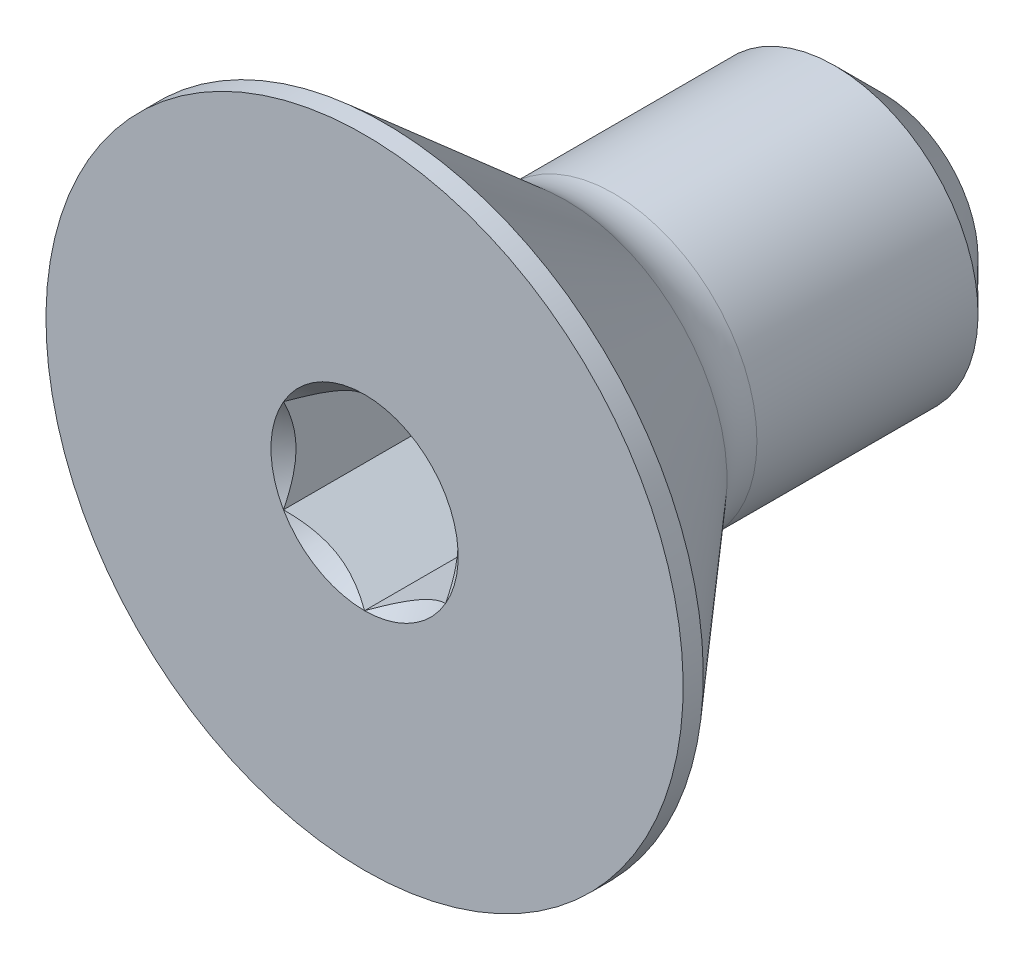
ISO-10303-21;
HEADER;
FILE_DESCRIPTION(('STEP AP214'),'2;1');
FILE_NAME('part.step','',(''),(''),'','','');
FILE_SCHEMA(('AUTOMOTIVE_DESIGN { 1 0 10303 214 1 1 1 1 }'));
ENDSEC;
DATA;
#1=APPLICATION_CONTEXT('core data for automotive mechanical design processes');
#2=APPLICATION_PROTOCOL_DEFINITION('international standard','automotive_design',2000,#1);
#3=PRODUCT_CONTEXT('',#1,'mechanical');
#4=PRODUCT('Part','Part','',(#3));
#5=PRODUCT_RELATED_PRODUCT_CATEGORY('part','',(#4));
#6=PRODUCT_DEFINITION_FORMATION('','',#4);
#7=PRODUCT_DEFINITION_CONTEXT('part definition',#1,'design');
#8=PRODUCT_DEFINITION('design','',#6,#7);
#9=PRODUCT_DEFINITION_SHAPE('','',#8);
#10=(LENGTH_UNIT() NAMED_UNIT(*) SI_UNIT(.MILLI.,.METRE.));
#11=(NAMED_UNIT(*) PLANE_ANGLE_UNIT() SI_UNIT($,.RADIAN.));
#12=(NAMED_UNIT(*) SI_UNIT($,.STERADIAN.) SOLID_ANGLE_UNIT());
#13=UNCERTAINTY_MEASURE_WITH_UNIT(LENGTH_MEASURE(1.E-05),#10,'distance_accuracy_value','');
#14=(GEOMETRIC_REPRESENTATION_CONTEXT(3) GLOBAL_UNCERTAINTY_ASSIGNED_CONTEXT((#13)) GLOBAL_UNIT_ASSIGNED_CONTEXT((#10,
#11,#12)) REPRESENTATION_CONTEXT('',''));
#15=CARTESIAN_POINT('',(0.,0.,0.));
#16=DIRECTION('',(0.,0.,1.));
#17=DIRECTION('',(1.,0.,0.));
#18=AXIS2_PLACEMENT_3D('',#15,#16,#17);
#19=CARTESIAN_POINT('',(0.,0.,-3.175));
#20=DIRECTION('',(0.,0.,-1.));
#21=DIRECTION('',(0.,1.,0.));
#22=AXIS2_PLACEMENT_3D('',#19,#20,#21);
#23=CYLINDRICAL_SURFACE('',#22,1.7526);
#24=CARTESIAN_POINT('',(0.,0.,-2.5796875));
#25=DIRECTION('',(0.,0.,-1.));
#26=DIRECTION('',(0.,1.,0.));
#27=AXIS2_PLACEMENT_3D('',#24,#25,#26);
#28=CIRCLE('',#27,1.7526);
#29=CARTESIAN_POINT('',(0.,1.7526,-2.5796875));
#30=VERTEX_POINT('',#29);
#31=EDGE_CURVE('E60',#30,#30,#28,.F.);
#32=ORIENTED_EDGE('',*,*,#31,.T.);
#33=EDGE_LOOP('',(#32));
#34=FACE_BOUND('',#33,.T.);
#35=CARTESIAN_POINT('',(0.,0.,0.126190199296428));
#36=DIRECTION('',(0.,0.,1.));
#37=DIRECTION('',(0.,-1.,0.));
#38=AXIS2_PLACEMENT_3D('',#35,#36,#37);
#39=CIRCLE('',#38,1.7526);
#40=CARTESIAN_POINT('',(0.,-1.7526,0.126190199296427));
#41=VERTEX_POINT('',#40);
#42=EDGE_CURVE('E243',#41,#41,#39,.T.);
#43=ORIENTED_EDGE('',*,*,#42,.F.);
#44=EDGE_LOOP('',(#43));
#45=FACE_BOUND('',#44,.T.);
#46=ADVANCED_FACE('F45',(#34,#45),#23,.T.);
#47=CARTESIAN_POINT('',(0.,1.7526,-3.175));
#48=DIRECTION('',(0.,0.,-1.));
#49=DIRECTION('',(0.,1.,0.));
#50=AXIS2_PLACEMENT_3D('',#47,#48,#49);
#51=PLANE('',#50);
#52=CARTESIAN_POINT('',(0.,0.,-3.175));
#53=DIRECTION('',(0.,0.,-1.));
#54=DIRECTION('',(0.,1.,0.));
#55=AXIS2_PLACEMENT_3D('',#52,#53,#54);
#56=CIRCLE('',#55,1.1572875);
#57=CARTESIAN_POINT('',(0.,1.1572875,-3.175));
#58=VERTEX_POINT('',#57);
#59=EDGE_CURVE('E247',#58,#58,#56,.T.);
#60=ORIENTED_EDGE('',*,*,#59,.T.);
#61=EDGE_LOOP('',(#60));
#62=FACE_BOUND('',#61,.T.);
#63=ADVANCED_FACE('F260',(#62),#51,.T.);
#64=CARTESIAN_POINT('',(0.,0.,0.126190199296428));
#65=DIRECTION('',(0.,0.,1.));
#66=DIRECTION('',(0.,-1.,0.));
#67=AXIS2_PLACEMENT_3D('',#64,#65,#66);
#68=TOROIDAL_SURFACE('',#67,2.64430299447558,0.891702994475579);
#69=CARTESIAN_POINT('',(0.,0.,0.711200000000005));
#70=DIRECTION('',(0.,0.,1.));
#71=DIRECTION('',(0.,-1.,0.));
#72=AXIS2_PLACEMENT_3D('',#69,#70,#71);
#73=CIRCLE('',#72,1.97132620183153);
#74=CARTESIAN_POINT('',(0.,-1.97132620183153,0.711200000000004));
#75=VERTEX_POINT('',#74);
#76=EDGE_CURVE('E239',#75,#75,#73,.T.);
#77=ORIENTED_EDGE('',*,*,#76,.F.);
#78=EDGE_LOOP('',(#77));
#79=FACE_BOUND('',#78,.T.);
#80=ORIENTED_EDGE('',*,*,#42,.T.);
#81=EDGE_LOOP('',(#80));
#82=FACE_BOUND('',#81,.T.);
#83=ADVANCED_FACE('F262',(#79,#82),#68,.F.);
#84=CARTESIAN_POINT('',(0.,0.,0.711200000000005));
#85=DIRECTION('',(0.,0.,1.));
#86=DIRECTION('',(0.,-1.,0.));
#87=AXIS2_PLACEMENT_3D('',#84,#85,#86);
#88=CONICAL_SURFACE('',#87,1.97132620183153,0.715584993317678);
#89=CARTESIAN_POINT('',(0.,0.,2.92862000000001));
#90=DIRECTION('',(0.,0.,1.));
#91=DIRECTION('',(0.,-1.,0.));
#92=AXIS2_PLACEMENT_3D('',#89,#90,#91);
#93=CIRCLE('',#92,3.8989);
#94=CARTESIAN_POINT('',(0.,-3.8989,2.92862));
#95=VERTEX_POINT('',#94);
#96=EDGE_CURVE('E235',#95,#95,#93,.T.);
#97=ORIENTED_EDGE('',*,*,#96,.F.);
#98=EDGE_LOOP('',(#97));
#99=FACE_BOUND('',#98,.T.);
#100=ORIENTED_EDGE('',*,*,#76,.T.);
#101=EDGE_LOOP('',(#100));
#102=FACE_BOUND('',#101,.T.);
#103=ADVANCED_FACE('F268',(#99,#102),#88,.T.);
#104=CARTESIAN_POINT('',(0.,0.,3.175));
#105=DIRECTION('',(0.,0.,1.));
#106=DIRECTION('',(0.,-1.,0.));
#107=AXIS2_PLACEMENT_3D('',#104,#105,#106);
#108=CYLINDRICAL_SURFACE('',#107,3.8989);
#109=CARTESIAN_POINT('',(0.,0.,3.17500000000001));
#110=DIRECTION('',(0.,0.,1.));
#111=DIRECTION('',(0.,-1.,0.));
#112=AXIS2_PLACEMENT_3D('',#109,#110,#111);
#113=CIRCLE('',#112,3.8989);
#114=CARTESIAN_POINT('',(0.,-3.8989,3.175));
#115=VERTEX_POINT('',#114);
#116=EDGE_CURVE('E218',#115,#115,#113,.T.);
#117=ORIENTED_EDGE('',*,*,#116,.F.);
#118=EDGE_LOOP('',(#117));
#119=FACE_BOUND('',#118,.T.);
#120=ORIENTED_EDGE('',*,*,#96,.T.);
#121=EDGE_LOOP('',(#120));
#122=FACE_BOUND('',#121,.T.);
#123=ADVANCED_FACE('F184',(#119,#122),#108,.T.);
#124=CARTESIAN_POINT('',(0.,1.7526,3.175));
#125=DIRECTION('',(0.,0.,1.));
#126=DIRECTION('',(0.,-1.,0.));
#127=AXIS2_PLACEMENT_3D('',#124,#125,#126);
#128=PLANE('',#127);
#129=CARTESIAN_POINT('',(0.,0.,3.175));
#130=DIRECTION('',(0.,0.,1.));
#131=DIRECTION('',(1.,0.,0.));
#132=AXIS2_PLACEMENT_3D('',#129,#130,#131);
#133=CIRCLE('',#132,1.14567944042316);
#134=CARTESIAN_POINT('',(0.,-1.14567944042316,3.175));
#135=VERTEX_POINT('',#134);
#136=CARTESIAN_POINT('',(0.992187499999999,-0.572839720211584,3.175));
#137=VERTEX_POINT('',#136);
#138=EDGE_CURVE('E73',#135,#137,#133,.T.);
#139=ORIENTED_EDGE('',*,*,#138,.F.);
#140=CARTESIAN_POINT('',(-0.9921875,-0.572839720211583,3.175));
#141=VERTEX_POINT('',#140);
#142=EDGE_CURVE('E150',#141,#135,#133,.T.);
#143=ORIENTED_EDGE('',*,*,#142,.F.);
#144=CARTESIAN_POINT('',(-0.992187499999997,0.572839720211586,3.175));
#145=VERTEX_POINT('',#144);
#146=EDGE_CURVE('E147',#145,#141,#133,.T.);
#147=ORIENTED_EDGE('',*,*,#146,.F.);
#148=CARTESIAN_POINT('',(0.,1.14567944042316,3.175));
#149=VERTEX_POINT('',#148);
#150=EDGE_CURVE('E115',#149,#145,#133,.T.);
#151=ORIENTED_EDGE('',*,*,#150,.F.);
#152=CARTESIAN_POINT('',(0.9921875,0.572839720211581,3.175));
#153=VERTEX_POINT('',#152);
#154=EDGE_CURVE('E105',#153,#149,#133,.T.);
#155=ORIENTED_EDGE('',*,*,#154,.F.);
#156=EDGE_CURVE('E66',#137,#153,#133,.T.);
#157=ORIENTED_EDGE('',*,*,#156,.F.);
#158=EDGE_LOOP('',(#139,#143,#147,#151,#155,#157));
#159=FACE_BOUND('',#158,.T.);
#160=ORIENTED_EDGE('',*,*,#116,.T.);
#161=EDGE_LOOP('',(#160));
#162=FACE_BOUND('',#161,.T.);
#163=ADVANCED_FACE('F143',(#159,#162),#128,.T.);
#164=CARTESIAN_POINT('',(0.,0.,-3.175));
#165=DIRECTION('',(0.,0.,1.));
#166=DIRECTION('',(0.,-1.,0.));
#167=AXIS2_PLACEMENT_3D('',#164,#165,#166);
#168=CONICAL_SURFACE('',#167,1.1572875,0.785398163397448);
#169=ORIENTED_EDGE('',*,*,#31,.F.);
#170=EDGE_LOOP('',(#169));
#171=FACE_BOUND('',#170,.T.);
#172=ORIENTED_EDGE('',*,*,#59,.F.);
#173=EDGE_LOOP('',(#172));
#174=FACE_BOUND('',#173,.T.);
#175=ADVANCED_FACE('F47',(#171,#174),#168,.T.);
#176=CARTESIAN_POINT('',(0.,0.,3.175));
#177=DIRECTION('',(0.,0.,1.));
#178=DIRECTION('',(1.,0.,0.));
#179=AXIS2_PLACEMENT_3D('',#176,#177,#178);
#180=CONICAL_SURFACE('',#179,1.14567944042316,0.78539816339745);
#181=ORIENTED_EDGE('',*,*,#150,.T.);
#182=CARTESIAN_POINT('',(0.000199999999998407,1.145794910477,3.17511548750897));
#183=CARTESIAN_POINT('',(-0.0339140752321575,1.12609913995856,3.15543281140466));
#184=CARTESIAN_POINT('',(-0.0685985894922812,1.10607402631377,3.13690568451841));
#185=CARTESIAN_POINT('',(-0.139324581199961,1.06524035596264,3.10298232965041));
#186=CARTESIAN_POINT('',(-0.175372791624243,1.04442791197037,3.08760498723095));
#187=CARTESIAN_POINT('',(-0.248062511737397,1.00246048249573,3.06126314273428));
#188=CARTESIAN_POINT('',(-0.284685489013202,0.981316196707013,3.05023239651314));
#189=CARTESIAN_POINT('',(-0.358737506246057,0.93856224462359,3.03323620567295));
#190=CARTESIAN_POINT('',(-0.396164282559343,0.916953885244214,3.02725806757892));
#191=CARTESIAN_POINT('',(-0.460664638605472,0.879714587318155,3.0218663449143));
#192=CARTESIAN_POINT('',(-0.48765429931453,0.864132099442443,3.02106899638835));
#193=CARTESIAN_POINT('',(-0.541581355945665,0.832997298779854,3.02240819336143));
#194=CARTESIAN_POINT('',(-0.568518739024241,0.817444993408174,3.02454538613705));
#195=CARTESIAN_POINT('',(-0.648946222958499,0.771010163908486,3.03521757130602));
#196=CARTESIAN_POINT('',(-0.702036069363284,0.740358726795447,3.04801438072272));
#197=CARTESIAN_POINT('',(-0.795214637965799,0.686562055130081,3.07889746765013));
#198=CARTESIAN_POINT('',(-0.835740306309517,0.663164549602746,3.09536500890771));
#199=CARTESIAN_POINT('',(-0.915204315708208,0.617285982385525,3.13246038355681));
#200=CARTESIAN_POINT('',(-0.954147338261524,0.59480221783131,3.15307468064554));
#201=CARTESIAN_POINT('',(-0.9923875,0.572724250157746,3.17511548750897));
#202=B_SPLINE_CURVE_WITH_KNOTS('',3,(#182,#183,#184,#185,#186,#187,#188,#189,#190,#191,#192,
#193,#194,#195,#196,#197,#198,#199,#200,#201),.UNSPECIFIED.,.F.,.F.,(4,2,2,2,2,2,2,2,2,4),(0.,
0.13219718521019,0.265165186853262,0.396020097605668,0.526545281028573,0.619935205043264,
0.713345731536163,0.900220051846369,1.04884529769095,1.19699303557669),.UNSPECIFIED.);
#203=EDGE_CURVE('E11',#149,#145,#202,.T.);
#204=ORIENTED_EDGE('',*,*,#203,.F.);
#205=EDGE_LOOP('',(#181,#204));
#206=FACE_BOUND('',#205,.T.);
#207=ADVANCED_FACE('F119',(#206),#180,.F.);
#208=ORIENTED_EDGE('',*,*,#146,.T.);
#209=CARTESIAN_POINT('',(-0.992187499999999,-1.14247621078911,3.54249203940829));
#210=CARTESIAN_POINT('',(-0.992187499999999,-1.11465764801141,3.5214916392497));
#211=CARTESIAN_POINT('',(-0.992187499999999,-1.08668408094051,3.50069714770579));
#212=CARTESIAN_POINT('',(-0.992187499999999,-1.03036405365905,3.45960503768691));
#213=CARTESIAN_POINT('',(-0.992187499999999,-1.00201750223733,3.43930754435707));
#214=CARTESIAN_POINT('',(-0.992187499999999,-0.915909012346498,3.37899850749393));
#215=CARTESIAN_POINT('',(-0.9921875,-0.857501195839068,3.33989385217264));
#216=CARTESIAN_POINT('',(-0.9921875,-0.735022281240405,3.26312675276114));
#217=CARTESIAN_POINT('',(-0.9921875,-0.670818221894544,3.22567403099626));
#218=CARTESIAN_POINT('',(-0.9921875,-0.539203244212804,3.15716502046105));
#219=CARTESIAN_POINT('',(-0.9921875,-0.471804118965063,3.12608716825431));
#220=CARTESIAN_POINT('',(-0.9921875,-0.370637445252799,3.08806629623627));
#221=CARTESIAN_POINT('',(-0.9921875,-0.338367677251605,3.07715403233245));
#222=CARTESIAN_POINT('',(-0.9921875,-0.273049086247198,3.05792023009933));
#223=CARTESIAN_POINT('',(-0.9921875,-0.240000209742887,3.04959887024719));
#224=CARTESIAN_POINT('',(-0.9921875,-0.173878395816095,3.03611877368215));
#225=CARTESIAN_POINT('',(-0.9921875,-0.140816774716471,3.03090539396509));
#226=CARTESIAN_POINT('',(-0.9921875,-0.074329167199215,3.02373971245706));
#227=CARTESIAN_POINT('',(-0.9921875,-0.040903125991958,3.02178790803543));
#228=CARTESIAN_POINT('',(-0.9921875,0.0247631141129249,3.02129348590571));
#229=CARTESIAN_POINT('',(-0.9921875,0.0570024445003665,3.02263003142075));
#230=CARTESIAN_POINT('',(-0.9921875,0.12119422050107,3.02837104321384));
#231=CARTESIAN_POINT('',(-0.9921875,0.153146730366262,3.03277480409387));
#232=CARTESIAN_POINT('',(-0.9921875,0.217090524657736,3.04448451115969));
#233=CARTESIAN_POINT('',(-0.9921875,0.249072542149664,3.05184030243665));
#234=CARTESIAN_POINT('',(-0.9921875,0.312337779758395,3.0690630913854));
#235=CARTESIAN_POINT('',(-0.9921875,0.343621058108105,3.07892987893501));
#236=CARTESIAN_POINT('',(-0.9921875,0.442112983138562,3.11370611159688));
#237=CARTESIAN_POINT('',(-0.9921875,0.507919771198879,3.14257616415081));
#238=CARTESIAN_POINT('',(-0.9921875,0.636441891183644,3.20676520992333));
#239=CARTESIAN_POINT('',(-0.9921875,0.699145053961294,3.24210737220965));
#240=CARTESIAN_POINT('',(-0.9921875,0.818979830095493,3.31502137086766));
#241=CARTESIAN_POINT('',(-0.9921875,0.876233471712467,3.35239513504847));
#242=CARTESIAN_POINT('',(-0.9921875,0.960585190784997,3.41017111190454));
#243=CARTESIAN_POINT('',(-0.9921875,0.988338378424188,3.42963348767096));
#244=CARTESIAN_POINT('',(-0.9921875,1.04346551341387,3.46907298177173));
#245=CARTESIAN_POINT('',(-0.9921875,1.07083956239906,3.48904995788478));
#246=CARTESIAN_POINT('',(-0.9921875,1.09805574523311,3.50924030564271));
#247=B_SPLINE_CURVE_WITH_KNOTS('',3,(#209,#210,#211,#212,#213,#214,#215,#216,#217,#218,#219,
#220,#221,#222,#223,#224,#225,#226,#227,#228,#229,#230,#231,#232,#233,#234,#235,#236,#237,#238,
#239,#240,#241,#242,#243,#244,#245,#246),.UNSPECIFIED.,.F.,.F.,(4,2,2,2,2,2,2,2,2,2,2,2,2,2,2,2,
2,2,4),(0.,0.104563127371702,0.209152318679108,0.419927098975114,0.642732653870156,
0.864771652131277,0.966879847039379,1.06899507422301,1.16925752982867,1.26953527342202,
1.36618351686957,1.46280954049584,1.56114078094885,1.65946379566814,1.87441437168727,
2.09015003608822,2.29516517576016,2.39685303378669,2.49851308339968),.UNSPECIFIED.);
#248=EDGE_CURVE('E114',#145,#141,#247,.F.);
#249=ORIENTED_EDGE('',*,*,#248,.F.);
#250=EDGE_LOOP('',(#208,#249));
#251=FACE_BOUND('',#250,.T.);
#252=ADVANCED_FACE('F304',(#251),#180,.F.);
#253=ORIENTED_EDGE('',*,*,#142,.T.);
#254=CARTESIAN_POINT('',(-0.992387499999999,-0.572724250157746,3.17511548750897));
#255=CARTESIAN_POINT('',(-0.958273424767843,-0.592420020676186,3.15543281140465));
#256=CARTESIAN_POINT('',(-0.92358891050772,-0.61244513432098,3.13690568451841));
#257=CARTESIAN_POINT('',(-0.85286291880004,-0.653278804672112,3.10298232965041));
#258=CARTESIAN_POINT('',(-0.816814708375757,-0.674091248664376,3.08760498723095));
#259=CARTESIAN_POINT('',(-0.744124988262603,-0.716058678139024,3.06126314273428));
#260=CARTESIAN_POINT('',(-0.707502010986797,-0.737202963927735,3.05023239651314));
#261=CARTESIAN_POINT('',(-0.633449993753942,-0.779956916011159,3.03323620567294));
#262=CARTESIAN_POINT('',(-0.596023217440656,-0.801565275390535,3.02725806757892));
#263=CARTESIAN_POINT('',(-0.531522861394527,-0.838804573316594,3.0218663449143));
#264=CARTESIAN_POINT('',(-0.504533200685469,-0.854387061192305,3.02106899638834));
#265=CARTESIAN_POINT('',(-0.450606144054334,-0.885521861854895,3.02240819336142));
#266=CARTESIAN_POINT('',(-0.423668760975759,-0.901074167226574,3.02454538613705));
#267=CARTESIAN_POINT('',(-0.343241277041501,-0.947508996726262,3.03521757130602));
#268=CARTESIAN_POINT('',(-0.290151430636715,-0.978160433839301,3.04801438072271));
#269=CARTESIAN_POINT('',(-0.196972862034201,-1.03195710550467,3.07889746765013));
#270=CARTESIAN_POINT('',(-0.156447193690482,-1.055354611032,3.09536500890771));
#271=CARTESIAN_POINT('',(-0.0769831842917922,-1.10123317824922,3.13246038355681));
#272=CARTESIAN_POINT('',(-0.0380401617384762,-1.12371694280344,3.15307468064554));
#273=CARTESIAN_POINT('',(0.000200000000000084,-1.145794910477,3.17511548750897));
#274=B_SPLINE_CURVE_WITH_KNOTS('',3,(#254,#255,#256,#257,#258,#259,#260,#261,#262,#263,#264,
#265,#266,#267,#268,#269,#270,#271,#272,#273),.UNSPECIFIED.,.F.,.F.,(4,2,2,2,2,2,2,2,2,4),(0.,
0.132197185210191,0.265165186853263,0.39602009760567,0.526545281028575,0.619935205043266,
0.713345731536165,0.90022005184637,1.04884529769095,1.19699303557669),.UNSPECIFIED.);
#275=EDGE_CURVE('E160',#141,#135,#274,.T.);
#276=ORIENTED_EDGE('',*,*,#275,.F.);
#277=EDGE_LOOP('',(#253,#276));
#278=FACE_BOUND('',#277,.T.);
#279=ADVANCED_FACE('F310',(#278),#180,.F.);
#280=ORIENTED_EDGE('',*,*,#138,.T.);
#281=CARTESIAN_POINT('',(-0.000199999999999938,-1.145794910477,3.17511548750897));
#282=CARTESIAN_POINT('',(0.033914075232156,-1.12609913995856,3.15543281140465));
#283=CARTESIAN_POINT('',(0.0685985894922797,-1.10607402631377,3.13690568451841));
#284=CARTESIAN_POINT('',(0.139324581199959,-1.06524035596263,3.10298232965041));
#285=CARTESIAN_POINT('',(0.175372791624242,-1.04442791197037,3.08760498723095));
#286=CARTESIAN_POINT('',(0.248062511737395,-1.00246048249572,3.06126314273428));
#287=CARTESIAN_POINT('',(0.284685489013201,-0.981316196707012,3.05023239651314));
#288=CARTESIAN_POINT('',(0.358737506246056,-0.938562244623588,3.03323620567294));
#289=CARTESIAN_POINT('',(0.396164282559342,-0.916953885244213,3.02725806757892));
#290=CARTESIAN_POINT('',(0.46066463860547,-0.879714587318154,3.0218663449143));
#291=CARTESIAN_POINT('',(0.487654299314529,-0.864132099442442,3.02106899638834));
#292=CARTESIAN_POINT('',(0.541581355945663,-0.832997298779853,3.02240819336142));
#293=CARTESIAN_POINT('',(0.568518739024239,-0.817444993408173,3.02454538613705));
#294=CARTESIAN_POINT('',(0.648946222958497,-0.771010163908485,3.03521757130602));
#295=CARTESIAN_POINT('',(0.702036069363282,-0.740358726795447,3.04801438072271));
#296=CARTESIAN_POINT('',(0.795214637965797,-0.686562055130081,3.07889746765013));
#297=CARTESIAN_POINT('',(0.835740306309516,-0.663164549602745,3.09536500890771));
#298=CARTESIAN_POINT('',(0.915204315708207,-0.617285982385524,3.13246038355681));
#299=CARTESIAN_POINT('',(0.954147338261523,-0.594802217831309,3.15307468064554));
#300=CARTESIAN_POINT('',(0.9923875,-0.572724250157745,3.17511548750897));
#301=B_SPLINE_CURVE_WITH_KNOTS('',3,(#281,#282,#283,#284,#285,#286,#287,#288,#289,#290,#291,
#292,#293,#294,#295,#296,#297,#298,#299,#300),.UNSPECIFIED.,.F.,.F.,(4,2,2,2,2,2,2,2,2,4),(0.,
0.13219718521019,0.265165186853262,0.396020097605668,0.526545281028572,0.619935205043263,
0.713345731536163,0.900220051846367,1.04884529769095,1.19699303557669),.UNSPECIFIED.);
#302=EDGE_CURVE('E464',#135,#137,#301,.T.);
#303=ORIENTED_EDGE('',*,*,#302,.F.);
#304=EDGE_LOOP('',(#280,#303));
#305=FACE_BOUND('',#304,.T.);
#306=ADVANCED_FACE('F317',(#305),#180,.F.);
#307=ORIENTED_EDGE('',*,*,#156,.T.);
#308=CARTESIAN_POINT('',(0.9921875,-1.14247621078911,3.54249203940829));
#309=CARTESIAN_POINT('',(0.9921875,-1.11465764801141,3.5214916392497));
#310=CARTESIAN_POINT('',(0.9921875,-1.08668408094051,3.50069714770579));
#311=CARTESIAN_POINT('',(0.9921875,-1.03036405365905,3.45960503768691));
#312=CARTESIAN_POINT('',(0.9921875,-1.00201750223733,3.43930754435707));
#313=CARTESIAN_POINT('',(0.9921875,-0.915909012346498,3.37899850749393));
#314=CARTESIAN_POINT('',(0.9921875,-0.857501195839068,3.33989385217264));
#315=CARTESIAN_POINT('',(0.9921875,-0.735022281240406,3.26312675276114));
#316=CARTESIAN_POINT('',(0.9921875,-0.670818221894544,3.22567403099626));
#317=CARTESIAN_POINT('',(0.9921875,-0.539203244212804,3.15716502046105));
#318=CARTESIAN_POINT('',(0.9921875,-0.471804118965063,3.12608716825431));
#319=CARTESIAN_POINT('',(0.9921875,-0.370637445252799,3.08806629623627));
#320=CARTESIAN_POINT('',(0.9921875,-0.338367677251605,3.07715403233245));
#321=CARTESIAN_POINT('',(0.9921875,-0.273049086247198,3.05792023009933));
#322=CARTESIAN_POINT('',(0.9921875,-0.240000209742887,3.04959887024719));
#323=CARTESIAN_POINT('',(0.9921875,-0.173878395816095,3.03611877368215));
#324=CARTESIAN_POINT('',(0.9921875,-0.140816774716471,3.03090539396509));
#325=CARTESIAN_POINT('',(0.9921875,-0.0743291671992146,3.02373971245706));
#326=CARTESIAN_POINT('',(0.9921875,-0.0409031259919577,3.02178790803543));
#327=CARTESIAN_POINT('',(0.9921875,0.0247631141129252,3.02129348590571));
#328=CARTESIAN_POINT('',(0.9921875,0.0570024445003668,3.02263003142075));
#329=CARTESIAN_POINT('',(0.9921875,0.121194220501071,3.02837104321384));
#330=CARTESIAN_POINT('',(0.9921875,0.153146730366263,3.03277480409387));
#331=CARTESIAN_POINT('',(0.9921875,0.217090524657736,3.04448451115969));
#332=CARTESIAN_POINT('',(0.9921875,0.249072542149665,3.05184030243665));
#333=CARTESIAN_POINT('',(0.9921875,0.312337779758396,3.06906309138541));
#334=CARTESIAN_POINT('',(0.9921875,0.343621058108106,3.07892987893501));
#335=CARTESIAN_POINT('',(0.9921875,0.442112983138563,3.11370611159688));
#336=CARTESIAN_POINT('',(0.9921875,0.50791977119888,3.14257616415081));
#337=CARTESIAN_POINT('',(0.9921875,0.636441891183645,3.20676520992333));
#338=CARTESIAN_POINT('',(0.9921875,0.699145053961295,3.24210737220965));
#339=CARTESIAN_POINT('',(0.9921875,0.818979830095495,3.31502137086766));
#340=CARTESIAN_POINT('',(0.9921875,0.876233471712469,3.35239513504847));
#341=CARTESIAN_POINT('',(0.9921875,0.960585190784998,3.41017111190455));
#342=CARTESIAN_POINT('',(0.9921875,0.988338378424189,3.42963348767096));
#343=CARTESIAN_POINT('',(0.9921875,1.04346551341387,3.46907298177173));
#344=CARTESIAN_POINT('',(0.9921875,1.07083956239906,3.48904995788478));
#345=CARTESIAN_POINT('',(0.9921875,1.09805574523311,3.50924030564271));
#346=B_SPLINE_CURVE_WITH_KNOTS('',3,(#308,#309,#310,#311,#312,#313,#314,#315,#316,#317,#318,
#319,#320,#321,#322,#323,#324,#325,#326,#327,#328,#329,#330,#331,#332,#333,#334,#335,#336,#337,
#338,#339,#340,#341,#342,#343,#344,#345),.UNSPECIFIED.,.F.,.F.,(4,2,2,2,2,2,2,2,2,2,2,2,2,2,2,2,
2,2,4),(0.,0.104563127371703,0.209152318679108,0.419927098975113,0.642732653870156,
0.864771652131277,0.966879847039379,1.06899507422301,1.16925752982867,1.26953527342202,
1.36618351686957,1.46280954049584,1.56114078094885,1.65946379566814,1.87441437168727,
2.09015003608822,2.29516517576017,2.39685303378669,2.49851308339968),.UNSPECIFIED.);
#347=EDGE_CURVE('E132',#137,#153,#346,.T.);
#348=ORIENTED_EDGE('',*,*,#347,.F.);
#349=EDGE_LOOP('',(#307,#348));
#350=FACE_BOUND('',#349,.T.);
#351=ADVANCED_FACE('F324',(#350),#180,.F.);
#352=ORIENTED_EDGE('',*,*,#154,.T.);
#353=CARTESIAN_POINT('',(0.9923875,0.572724250157744,3.17511548750897));
#354=CARTESIAN_POINT('',(0.958273424767844,0.592420020676185,3.15543281140465));
#355=CARTESIAN_POINT('',(0.92358891050772,0.612445134320978,3.13690568451841));
#356=CARTESIAN_POINT('',(0.852862918800041,0.653278804672111,3.10298232965041));
#357=CARTESIAN_POINT('',(0.816814708375757,0.674091248664375,3.08760498723095));
#358=CARTESIAN_POINT('',(0.744124988262604,0.716058678139022,3.06126314273428));
#359=CARTESIAN_POINT('',(0.707502010986799,0.737202963927734,3.05023239651314));
#360=CARTESIAN_POINT('',(0.633449993753943,0.779956916011158,3.03323620567294));
#361=CARTESIAN_POINT('',(0.596023217440657,0.801565275390534,3.02725806757892));
#362=CARTESIAN_POINT('',(0.531522861394529,0.838804573316593,3.0218663449143));
#363=CARTESIAN_POINT('',(0.50453320068547,0.854387061192304,3.02106899638834));
#364=CARTESIAN_POINT('',(0.450606144054336,0.885521861854894,3.02240819336142));
#365=CARTESIAN_POINT('',(0.42366876097576,0.901074167226574,3.02454538613705));
#366=CARTESIAN_POINT('',(0.343241277041502,0.947508996726262,3.03521757130602));
#367=CARTESIAN_POINT('',(0.290151430636717,0.978160433839301,3.04801438072271));
#368=CARTESIAN_POINT('',(0.196972862034202,1.03195710550467,3.07889746765013));
#369=CARTESIAN_POINT('',(0.156447193690483,1.055354611032,3.09536500890771));
#370=CARTESIAN_POINT('',(0.0769831842917916,1.10123317824922,3.13246038355681));
#371=CARTESIAN_POINT('',(0.0380401617384753,1.12371694280344,3.15307468064554));
#372=CARTESIAN_POINT('',(-0.000200000000001275,1.145794910477,3.17511548750897));
#373=B_SPLINE_CURVE_WITH_KNOTS('',3,(#353,#354,#355,#356,#357,#358,#359,#360,#361,#362,#363,
#364,#365,#366,#367,#368,#369,#370,#371,#372),.UNSPECIFIED.,.F.,.F.,(4,2,2,2,2,2,2,2,2,4),(0.,
0.13219718521019,0.265165186853263,0.396020097605669,0.526545281028574,0.619935205043265,
0.713345731536164,0.90022005184637,1.04884529769095,1.1969930355767),.UNSPECIFIED.);
#374=EDGE_CURVE('E109',#153,#149,#373,.T.);
#375=ORIENTED_EDGE('',*,*,#374,.F.);
#376=EDGE_LOOP('',(#352,#375));
#377=FACE_BOUND('',#376,.T.);
#378=ADVANCED_FACE('F107',(#377),#180,.F.);
#379=CARTESIAN_POINT('',(0.,1.14567944042316,1.45034));
#380=DIRECTION('',(0.,0.,1.));
#381=DIRECTION('',(1.,0.,0.));
#382=AXIS2_PLACEMENT_3D('',#379,#380,#381);
#383=PLANE('',#382);
#384=DIRECTION('',(-0.866025403784439,0.5,0.));
#385=VECTOR('',#384,1.);
#386=CARTESIAN_POINT('',(0.9921875,0.572839720211582,1.45034));
#387=LINE('',#386,#385);
#388=CARTESIAN_POINT('',(0.9921875,0.572839720211582,1.45034));
#389=VERTEX_POINT('',#388);
#390=CARTESIAN_POINT('',(0.,1.14567944042316,1.45034));
#391=VERTEX_POINT('',#390);
#392=EDGE_CURVE('E131',#389,#391,#387,.T.);
#393=ORIENTED_EDGE('',*,*,#392,.T.);
#394=DIRECTION('',(-0.866025403784439,-0.5,0.));
#395=VECTOR('',#394,1.);
#396=CARTESIAN_POINT('',(0.,1.14567944042316,1.45034));
#397=LINE('',#396,#395);
#398=CARTESIAN_POINT('',(-0.9921875,0.572839720211584,1.45034));
#399=VERTEX_POINT('',#398);
#400=EDGE_CURVE('E136',#391,#399,#397,.T.);
#401=ORIENTED_EDGE('',*,*,#400,.T.);
#402=DIRECTION('',(0.,-1.,0.));
#403=VECTOR('',#402,1.);
#404=CARTESIAN_POINT('',(-0.9921875,0.572839720211584,1.45034));
#405=LINE('',#404,#403);
#406=CARTESIAN_POINT('',(-0.9921875,-0.572839720211583,1.45034));
#407=VERTEX_POINT('',#406);
#408=EDGE_CURVE('E201',#399,#407,#405,.T.);
#409=ORIENTED_EDGE('',*,*,#408,.T.);
#410=DIRECTION('',(0.866025403784439,-0.499999999999999,0.));
#411=VECTOR('',#410,1.);
#412=CARTESIAN_POINT('',(-0.9921875,-0.572839720211583,1.45034));
#413=LINE('',#412,#411);
#414=CARTESIAN_POINT('',(0.,-1.14567944042316,1.45034));
#415=VERTEX_POINT('',#414);
#416=EDGE_CURVE('E205',#407,#415,#413,.T.);
#417=ORIENTED_EDGE('',*,*,#416,.T.);
#418=DIRECTION('',(0.866025403784439,0.499999999999999,0.));
#419=VECTOR('',#418,1.);
#420=CARTESIAN_POINT('',(0.,-1.14567944042316,1.45034));
#421=LINE('',#420,#419);
#422=CARTESIAN_POINT('',(0.9921875,-0.572839720211583,1.45034));
#423=VERTEX_POINT('',#422);
#424=EDGE_CURVE('E209',#415,#423,#421,.T.);
#425=ORIENTED_EDGE('',*,*,#424,.T.);
#426=DIRECTION('',(0.,1.,0.));
#427=VECTOR('',#426,1.);
#428=CARTESIAN_POINT('',(0.9921875,-0.572839720211583,1.45034));
#429=LINE('',#428,#427);
#430=EDGE_CURVE('E140',#423,#389,#429,.T.);
#431=ORIENTED_EDGE('',*,*,#430,.T.);
#432=EDGE_LOOP('',(#393,#401,#409,#417,#425,#431));
#433=FACE_BOUND('',#432,.T.);
#434=ADVANCED_FACE('F179',(#433),#383,.T.);
#435=CARTESIAN_POINT('',(0.,1.14567944042316,1.45034));
#436=DIRECTION('',(-0.5,0.866025403784439,0.));
#437=DIRECTION('',(-0.866025403784439,-0.5,0.));
#438=AXIS2_PLACEMENT_3D('',#435,#436,#437);
#439=PLANE('',#438);
#440=DIRECTION('',(0.,0.,1.));
#441=VECTOR('',#440,1.);
#442=CARTESIAN_POINT('',(0.,1.14567944042316,1.45034));
#443=LINE('',#442,#441);
#444=EDGE_CURVE('E127',#391,#149,#443,.T.);
#445=ORIENTED_EDGE('',*,*,#444,.T.);
#446=ORIENTED_EDGE('',*,*,#203,.T.);
#447=DIRECTION('',(0.,0.,1.));
#448=VECTOR('',#447,1.);
#449=CARTESIAN_POINT('',(-0.9921875,0.572839720211584,1.45034));
#450=LINE('',#449,#448);
#451=EDGE_CURVE('E139',#399,#145,#450,.T.);
#452=ORIENTED_EDGE('',*,*,#451,.F.);
#453=ORIENTED_EDGE('',*,*,#400,.F.);
#454=EDGE_LOOP('',(#445,#446,#452,#453));
#455=FACE_BOUND('',#454,.T.);
#456=ADVANCED_FACE('F134',(#455),#439,.F.);
#457=CARTESIAN_POINT('',(-0.9921875,0.572839720211584,1.45034));
#458=DIRECTION('',(-1.,0.,0.));
#459=DIRECTION('',(0.,-1.,0.));
#460=AXIS2_PLACEMENT_3D('',#457,#458,#459);
#461=PLANE('',#460);
#462=ORIENTED_EDGE('',*,*,#451,.T.);
#463=ORIENTED_EDGE('',*,*,#248,.T.);
#464=DIRECTION('',(0.,0.,1.));
#465=VECTOR('',#464,1.);
#466=CARTESIAN_POINT('',(-0.9921875,-0.572839720211583,1.45034));
#467=LINE('',#466,#465);
#468=EDGE_CURVE('E227',#407,#141,#467,.T.);
#469=ORIENTED_EDGE('',*,*,#468,.F.);
#470=ORIENTED_EDGE('',*,*,#408,.F.);
#471=EDGE_LOOP('',(#462,#463,#469,#470));
#472=FACE_BOUND('',#471,.T.);
#473=ADVANCED_FACE('F169',(#472),#461,.F.);
#474=CARTESIAN_POINT('',(-0.9921875,-0.572839720211583,1.45034));
#475=DIRECTION('',(-0.499999999999999,-0.866025403784439,0.));
#476=DIRECTION('',(0.866025403784439,-0.499999999999999,0.));
#477=AXIS2_PLACEMENT_3D('',#474,#475,#476);
#478=PLANE('',#477);
#479=ORIENTED_EDGE('',*,*,#468,.T.);
#480=ORIENTED_EDGE('',*,*,#275,.T.);
#481=DIRECTION('',(0.,0.,1.));
#482=VECTOR('',#481,1.);
#483=CARTESIAN_POINT('',(0.,-1.14567944042316,1.45034));
#484=LINE('',#483,#482);
#485=EDGE_CURVE('E223',#415,#135,#484,.T.);
#486=ORIENTED_EDGE('',*,*,#485,.F.);
#487=ORIENTED_EDGE('',*,*,#416,.F.);
#488=EDGE_LOOP('',(#479,#480,#486,#487));
#489=FACE_BOUND('',#488,.T.);
#490=ADVANCED_FACE('F172',(#489),#478,.F.);
#491=CARTESIAN_POINT('',(0.,-1.14567944042316,1.45034));
#492=DIRECTION('',(0.499999999999999,-0.866025403784439,0.));
#493=DIRECTION('',(0.866025403784439,0.499999999999999,0.));
#494=AXIS2_PLACEMENT_3D('',#491,#492,#493);
#495=PLANE('',#494);
#496=ORIENTED_EDGE('',*,*,#485,.T.);
#497=ORIENTED_EDGE('',*,*,#302,.T.);
#498=DIRECTION('',(0.,0.,1.));
#499=VECTOR('',#498,1.);
#500=CARTESIAN_POINT('',(0.9921875,-0.572839720211583,1.45034));
#501=LINE('',#500,#499);
#502=EDGE_CURVE('E219',#423,#137,#501,.T.);
#503=ORIENTED_EDGE('',*,*,#502,.F.);
#504=ORIENTED_EDGE('',*,*,#424,.F.);
#505=EDGE_LOOP('',(#496,#497,#503,#504));
#506=FACE_BOUND('',#505,.T.);
#507=ADVANCED_FACE('F353',(#506),#495,.F.);
#508=CARTESIAN_POINT('',(0.9921875,-0.572839720211583,1.45034));
#509=DIRECTION('',(1.,0.,0.));
#510=DIRECTION('',(0.,0.,-1.));
#511=AXIS2_PLACEMENT_3D('',#508,#509,#510);
#512=PLANE('',#511);
#513=ORIENTED_EDGE('',*,*,#502,.T.);
#514=ORIENTED_EDGE('',*,*,#347,.T.);
#515=DIRECTION('',(0.,0.,1.));
#516=VECTOR('',#515,1.);
#517=CARTESIAN_POINT('',(0.9921875,0.572839720211582,1.45034));
#518=LINE('',#517,#516);
#519=EDGE_CURVE('E129',#389,#153,#518,.T.);
#520=ORIENTED_EDGE('',*,*,#519,.F.);
#521=ORIENTED_EDGE('',*,*,#430,.F.);
#522=EDGE_LOOP('',(#513,#514,#520,#521));
#523=FACE_BOUND('',#522,.T.);
#524=ADVANCED_FACE('F183',(#523),#512,.F.);
#525=CARTESIAN_POINT('',(0.9921875,0.572839720211582,1.45034));
#526=DIRECTION('',(0.5,0.866025403784439,0.));
#527=DIRECTION('',(-0.866025403784439,0.5,0.));
#528=AXIS2_PLACEMENT_3D('',#525,#526,#527);
#529=PLANE('',#528);
#530=ORIENTED_EDGE('',*,*,#519,.T.);
#531=ORIENTED_EDGE('',*,*,#374,.T.);
#532=ORIENTED_EDGE('',*,*,#444,.F.);
#533=ORIENTED_EDGE('',*,*,#392,.F.);
#534=EDGE_LOOP('',(#530,#531,#532,#533));
#535=FACE_BOUND('',#534,.T.);
#536=ADVANCED_FACE('F125',(#535),#529,.F.);
#537=CLOSED_SHELL('',(#46,#63,#83,#103,#123,#163,#175,#207,#252,#279,#306,#351,#378,#434,#456,
#473,#490,#507,#524,#536));
#538=MANIFOLD_SOLID_BREP('B2',#537);
#539=ADVANCED_BREP_SHAPE_REPRESENTATION('',(#18,#538),#14);
#540=SHAPE_DEFINITION_REPRESENTATION(#9,#539);
ENDSEC;
END-ISO-10303-21;
